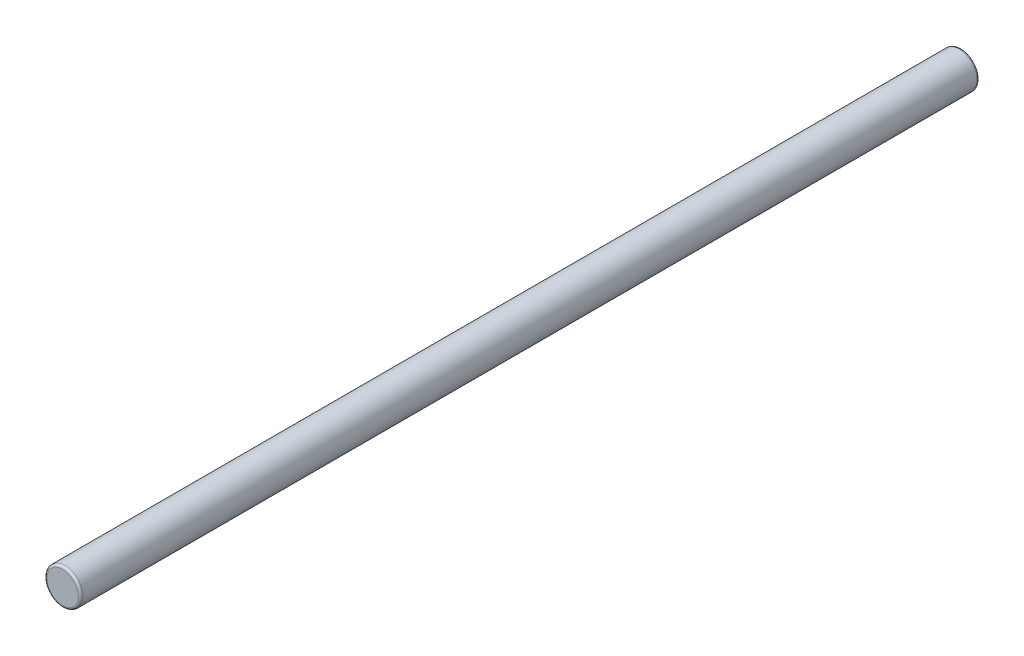
ISO-10303-21;
HEADER;
FILE_DESCRIPTION(('STEP AP214'),'2;1');
FILE_NAME('part.step','',(''),(''),'','','');
FILE_SCHEMA(('AUTOMOTIVE_DESIGN { 1 0 10303 214 1 1 1 1 }'));
ENDSEC;
DATA;
#1=APPLICATION_CONTEXT('core data for automotive mechanical design processes');
#2=APPLICATION_PROTOCOL_DEFINITION('international standard','automotive_design',2000,#1);
#3=PRODUCT_CONTEXT('',#1,'mechanical');
#4=PRODUCT('Part','Part','',(#3));
#5=PRODUCT_RELATED_PRODUCT_CATEGORY('part','',(#4));
#6=PRODUCT_DEFINITION_FORMATION('','',#4);
#7=PRODUCT_DEFINITION_CONTEXT('part definition',#1,'design');
#8=PRODUCT_DEFINITION('design','',#6,#7);
#9=PRODUCT_DEFINITION_SHAPE('','',#8);
#10=(LENGTH_UNIT() NAMED_UNIT(*) SI_UNIT(.MILLI.,.METRE.));
#11=(NAMED_UNIT(*) PLANE_ANGLE_UNIT() SI_UNIT($,.RADIAN.));
#12=(NAMED_UNIT(*) SI_UNIT($,.STERADIAN.) SOLID_ANGLE_UNIT());
#13=UNCERTAINTY_MEASURE_WITH_UNIT(LENGTH_MEASURE(1.E-05),#10,'distance_accuracy_value','');
#14=(GEOMETRIC_REPRESENTATION_CONTEXT(3) GLOBAL_UNCERTAINTY_ASSIGNED_CONTEXT((#13)) GLOBAL_UNIT_ASSIGNED_CONTEXT((#10,
#11,#12)) REPRESENTATION_CONTEXT('',''));
#15=CARTESIAN_POINT('',(0.,0.,0.));
#16=DIRECTION('',(0.,0.,1.));
#17=DIRECTION('',(1.,0.,0.));
#18=AXIS2_PLACEMENT_3D('',#15,#16,#17);
#19=CARTESIAN_POINT('',(0.,0.,200.));
#20=DIRECTION('',(0.,0.,-1.));
#21=DIRECTION('',(-1.,0.,0.));
#22=AXIS2_PLACEMENT_3D('',#19,#20,#21);
#23=CYLINDRICAL_SURFACE('',#22,4.);
#24=CARTESIAN_POINT('',(0.,0.,0.5));
#25=DIRECTION('',(0.,0.,1.));
#26=DIRECTION('',(1.,0.,0.));
#27=AXIS2_PLACEMENT_3D('',#24,#25,#26);
#28=CIRCLE('',#27,4.);
#29=CARTESIAN_POINT('',(4.,0.,0.5));
#30=VERTEX_POINT('',#29);
#31=EDGE_CURVE('E42',#30,#30,#28,.T.);
#32=ORIENTED_EDGE('',*,*,#31,.T.);
#33=EDGE_LOOP('',(#32));
#34=FACE_BOUND('',#33,.T.);
#35=CARTESIAN_POINT('',(0.,0.,199.5));
#36=DIRECTION('',(0.,0.,1.));
#37=DIRECTION('',(1.,0.,0.));
#38=AXIS2_PLACEMENT_3D('',#35,#36,#37);
#39=CIRCLE('',#38,4.);
#40=CARTESIAN_POINT('',(4.,0.,199.5));
#41=VERTEX_POINT('',#40);
#42=EDGE_CURVE('E46',#41,#41,#39,.F.);
#43=ORIENTED_EDGE('',*,*,#42,.T.);
#44=EDGE_LOOP('',(#43));
#45=FACE_BOUND('',#44,.T.);
#46=ADVANCED_FACE('F31',(#34,#45),#23,.T.);
#47=CARTESIAN_POINT('',(0.,0.,200.));
#48=DIRECTION('',(0.,0.,1.));
#49=DIRECTION('',(1.,0.,0.));
#50=AXIS2_PLACEMENT_3D('',#47,#48,#49);
#51=PLANE('',#50);
#52=CARTESIAN_POINT('',(0.,0.,200.));
#53=DIRECTION('',(0.,0.,1.));
#54=DIRECTION('',(1.,0.,0.));
#55=AXIS2_PLACEMENT_3D('',#52,#53,#54);
#56=CIRCLE('',#55,3.5);
#57=CARTESIAN_POINT('',(3.5,0.,200.));
#58=VERTEX_POINT('',#57);
#59=EDGE_CURVE('E10',#58,#58,#56,.T.);
#60=ORIENTED_EDGE('',*,*,#59,.T.);
#61=EDGE_LOOP('',(#60));
#62=FACE_BOUND('',#61,.T.);
#63=ADVANCED_FACE('F62',(#62),#51,.T.);
#64=CARTESIAN_POINT('',(0.,0.,0.));
#65=DIRECTION('',(0.,0.,1.));
#66=DIRECTION('',(1.,0.,0.));
#67=AXIS2_PLACEMENT_3D('',#64,#65,#66);
#68=PLANE('',#67);
#69=CARTESIAN_POINT('',(0.,0.,0.));
#70=DIRECTION('',(0.,0.,1.));
#71=DIRECTION('',(1.,0.,0.));
#72=AXIS2_PLACEMENT_3D('',#69,#70,#71);
#73=CIRCLE('',#72,3.5);
#74=CARTESIAN_POINT('',(3.5,0.,0.));
#75=VERTEX_POINT('',#74);
#76=EDGE_CURVE('E38',#75,#75,#73,.F.);
#77=ORIENTED_EDGE('',*,*,#76,.T.);
#78=EDGE_LOOP('',(#77));
#79=FACE_BOUND('',#78,.T.);
#80=ADVANCED_FACE('F59',(#79),#68,.F.);
#81=CARTESIAN_POINT('',(0.,0.,0.5));
#82=DIRECTION('',(0.,0.,1.));
#83=DIRECTION('',(1.,0.,0.));
#84=AXIS2_PLACEMENT_3D('',#81,#82,#83);
#85=TOROIDAL_SURFACE('',#84,3.5,0.5);
#86=ORIENTED_EDGE('',*,*,#76,.F.);
#87=EDGE_LOOP('',(#86));
#88=FACE_BOUND('',#87,.T.);
#89=ORIENTED_EDGE('',*,*,#31,.F.);
#90=EDGE_LOOP('',(#89));
#91=FACE_BOUND('',#90,.T.);
#92=ADVANCED_FACE('F55',(#88,#91),#85,.T.);
#93=CARTESIAN_POINT('',(0.,0.,199.5));
#94=DIRECTION('',(0.,0.,1.));
#95=DIRECTION('',(1.,0.,0.));
#96=AXIS2_PLACEMENT_3D('',#93,#94,#95);
#97=TOROIDAL_SURFACE('',#96,3.5,0.5);
#98=ORIENTED_EDGE('',*,*,#42,.F.);
#99=EDGE_LOOP('',(#98));
#100=FACE_BOUND('',#99,.T.);
#101=ORIENTED_EDGE('',*,*,#59,.F.);
#102=EDGE_LOOP('',(#101));
#103=FACE_BOUND('',#102,.T.);
#104=ADVANCED_FACE('F33',(#100,#103),#97,.T.);
#105=CLOSED_SHELL('',(#46,#63,#80,#92,#104));
#106=MANIFOLD_SOLID_BREP('B2',#105);
#107=ADVANCED_BREP_SHAPE_REPRESENTATION('',(#18,#106),#14);
#108=SHAPE_DEFINITION_REPRESENTATION(#9,#107);
ENDSEC;
END-ISO-10303-21;
